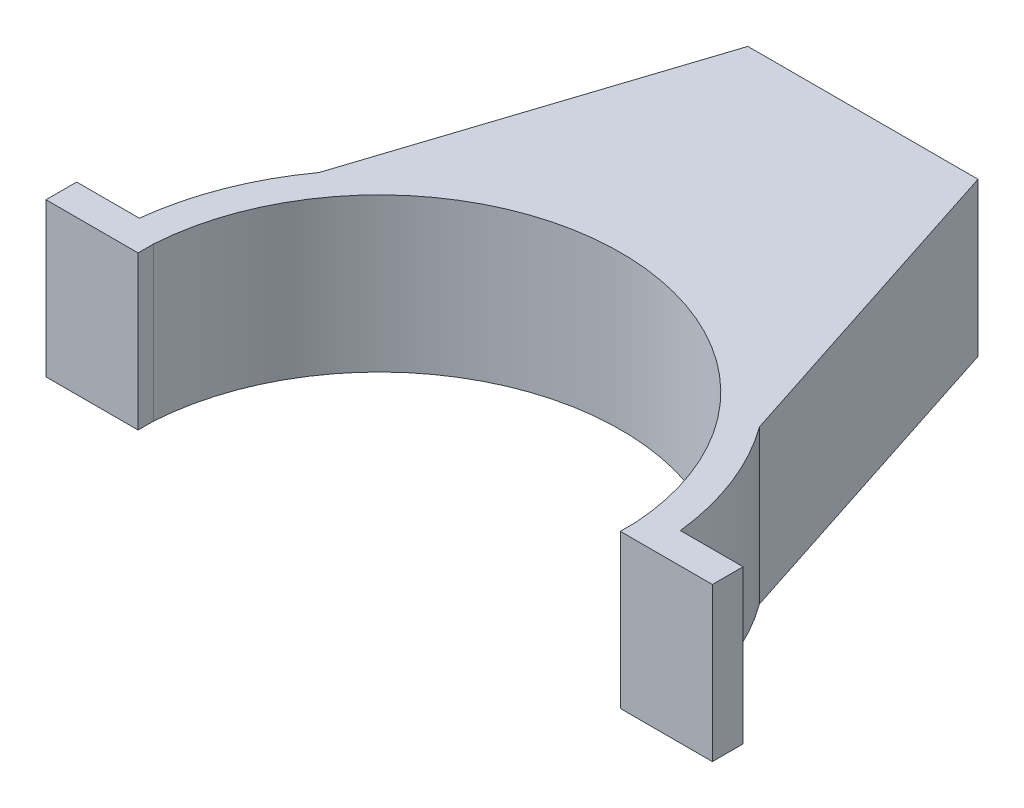
ISO-10303-21;
HEADER;
FILE_DESCRIPTION(('STEP AP214'),'2;1');
FILE_NAME('part.step','',(''),(''),'','','');
FILE_SCHEMA(('AUTOMOTIVE_DESIGN { 1 0 10303 214 1 1 1 1 }'));
ENDSEC;
DATA;
#1=APPLICATION_CONTEXT('core data for automotive mechanical design processes');
#2=APPLICATION_PROTOCOL_DEFINITION('international standard','automotive_design',2000,#1);
#3=PRODUCT_CONTEXT('',#1,'mechanical');
#4=PRODUCT('Part','Part','',(#3));
#5=PRODUCT_RELATED_PRODUCT_CATEGORY('part','',(#4));
#6=PRODUCT_DEFINITION_FORMATION('','',#4);
#7=PRODUCT_DEFINITION_CONTEXT('part definition',#1,'design');
#8=PRODUCT_DEFINITION('design','',#6,#7);
#9=PRODUCT_DEFINITION_SHAPE('','',#8);
#10=(LENGTH_UNIT() NAMED_UNIT(*) SI_UNIT(.MILLI.,.METRE.));
#11=(NAMED_UNIT(*) PLANE_ANGLE_UNIT() SI_UNIT($,.RADIAN.));
#12=(NAMED_UNIT(*) SI_UNIT($,.STERADIAN.) SOLID_ANGLE_UNIT());
#13=UNCERTAINTY_MEASURE_WITH_UNIT(LENGTH_MEASURE(1.E-05),#10,'distance_accuracy_value','');
#14=(GEOMETRIC_REPRESENTATION_CONTEXT(3) GLOBAL_UNCERTAINTY_ASSIGNED_CONTEXT((#13)) GLOBAL_UNIT_ASSIGNED_CONTEXT((#10,
#11,#12)) REPRESENTATION_CONTEXT('',''));
#15=CARTESIAN_POINT('',(0.,0.,0.));
#16=DIRECTION('',(0.,0.,1.));
#17=DIRECTION('',(1.,0.,0.));
#18=AXIS2_PLACEMENT_3D('',#15,#16,#17);
#19=CARTESIAN_POINT('',(0.,25.4,0.));
#20=DIRECTION('',(0.,-1.,0.));
#21=DIRECTION('',(0.,0.,-1.));
#22=AXIS2_PLACEMENT_3D('',#19,#20,#21);
#23=CYLINDRICAL_SURFACE('',#22,45.0723);
#24=DIRECTION('',(0.,-1.,0.));
#25=VECTOR('',#24,1.);
#26=CARTESIAN_POINT('',(-44.7851072041812,25.4,-5.08));
#27=LINE('',#26,#25);
#28=CARTESIAN_POINT('',(-44.7851072041812,25.4,-5.08));
#29=VERTEX_POINT('',#28);
#30=CARTESIAN_POINT('',(-44.7851072041812,0.,-5.08));
#31=VERTEX_POINT('',#30);
#32=EDGE_CURVE('E227',#29,#31,#27,.T.);
#33=ORIENTED_EDGE('',*,*,#32,.F.);
#34=CARTESIAN_POINT('',(0.,25.4,0.));
#35=DIRECTION('',(0.,1.,0.));
#36=DIRECTION('',(0.,0.,1.));
#37=AXIS2_PLACEMENT_3D('',#34,#35,#36);
#38=CIRCLE('',#37,45.0723);
#39=CARTESIAN_POINT('',(-36.4636625539692,25.4,-26.4936509458449));
#40=VERTEX_POINT('',#39);
#41=EDGE_CURVE('E277',#40,#29,#38,.T.);
#42=ORIENTED_EDGE('',*,*,#41,.F.);
#43=DIRECTION('',(0.,-1.,0.));
#44=VECTOR('',#43,1.);
#45=CARTESIAN_POINT('',(-36.4636625539691,25.4,-26.4936509458449));
#46=LINE('',#45,#44);
#47=CARTESIAN_POINT('',(-36.4636625539692,0.,-26.4936509458449));
#48=VERTEX_POINT('',#47);
#49=EDGE_CURVE('E288',#48,#40,#46,.F.);
#50=ORIENTED_EDGE('',*,*,#49,.F.);
#51=CARTESIAN_POINT('',(0.,0.,0.));
#52=DIRECTION('',(0.,1.,0.));
#53=DIRECTION('',(0.,0.,1.));
#54=AXIS2_PLACEMENT_3D('',#51,#52,#53);
#55=CIRCLE('',#54,45.0723);
#56=EDGE_CURVE('E281',#48,#31,#55,.T.);
#57=ORIENTED_EDGE('',*,*,#56,.T.);
#58=EDGE_LOOP('',(#33,#42,#50,#57));
#59=FACE_BOUND('',#58,.T.);
#60=ADVANCED_FACE('F33',(#59),#23,.T.);
#61=CARTESIAN_POINT('',(44.7851072041812,25.4,-5.08));
#62=VERTEX_POINT('',#61);
#63=CARTESIAN_POINT('',(36.4636625539692,25.4,-26.4936509458449));
#64=VERTEX_POINT('',#63);
#65=EDGE_CURVE('E47',#62,#64,#38,.T.);
#66=ORIENTED_EDGE('',*,*,#65,.F.);
#67=DIRECTION('',(0.,-1.,0.));
#68=VECTOR('',#67,1.);
#69=CARTESIAN_POINT('',(44.7851072041812,25.4,-5.08));
#70=LINE('',#69,#68);
#71=CARTESIAN_POINT('',(44.7851072041812,0.,-5.08));
#72=VERTEX_POINT('',#71);
#73=EDGE_CURVE('E51',#62,#72,#70,.T.);
#74=ORIENTED_EDGE('',*,*,#73,.T.);
#75=CARTESIAN_POINT('',(36.4636625539692,0.,-26.4936509458449));
#76=VERTEX_POINT('',#75);
#77=EDGE_CURVE('E283',#72,#76,#55,.T.);
#78=ORIENTED_EDGE('',*,*,#77,.T.);
#79=DIRECTION('',(0.,-1.,0.));
#80=VECTOR('',#79,1.);
#81=CARTESIAN_POINT('',(36.4636625539692,25.4,-26.4936509458449));
#82=LINE('',#81,#80);
#83=EDGE_CURVE('E291',#64,#76,#82,.T.);
#84=ORIENTED_EDGE('',*,*,#83,.F.);
#85=EDGE_LOOP('',(#66,#74,#78,#84));
#86=FACE_BOUND('',#85,.T.);
#87=ADVANCED_FACE('F321',(#86),#23,.T.);
#88=CARTESIAN_POINT('',(0.,12.7,0.));
#89=DIRECTION('',(0.,-1.,0.));
#90=DIRECTION('',(0.,0.,1.));
#91=AXIS2_PLACEMENT_3D('',#88,#89,#90);
#92=CIRCLE('',#91,45.0723);
#93=CARTESIAN_POINT('',(-32.1308346523782,12.7,-31.6088862795185));
#94=VERTEX_POINT('',#93);
#95=CARTESIAN_POINT('',(32.1308346523782,12.7,-31.6088862795184));
#96=VERTEX_POINT('',#95);
#97=EDGE_CURVE('E232',#94,#96,#92,.T.);
#98=ORIENTED_EDGE('',*,*,#97,.T.);
#99=DIRECTION('',(0.,-1.,0.));
#100=VECTOR('',#99,1.);
#101=CARTESIAN_POINT('',(32.1308346523782,25.4,-31.6088862795184));
#102=LINE('',#101,#100);
#103=CARTESIAN_POINT('',(32.1308346523783,0.,-31.6088862795184));
#104=VERTEX_POINT('',#103);
#105=EDGE_CURVE('E280',#104,#96,#102,.F.);
#106=ORIENTED_EDGE('',*,*,#105,.F.);
#107=CARTESIAN_POINT('',(-32.1308346523783,0.,-31.6088862795184));
#108=VERTEX_POINT('',#107);
#109=EDGE_CURVE('E274',#104,#108,#55,.T.);
#110=ORIENTED_EDGE('',*,*,#109,.T.);
#111=DIRECTION('',(0.,-1.,0.));
#112=VECTOR('',#111,1.);
#113=CARTESIAN_POINT('',(-32.1308346523782,25.4,-31.6088862795185));
#114=LINE('',#113,#112);
#115=EDGE_CURVE('E286',#94,#108,#114,.T.);
#116=ORIENTED_EDGE('',*,*,#115,.F.);
#117=EDGE_LOOP('',(#98,#106,#110,#116));
#118=FACE_BOUND('',#117,.T.);
#119=ADVANCED_FACE('F323',(#118),#23,.T.);
#120=CARTESIAN_POINT('',(-17.2046037357605,25.4,-77.5453488522659));
#121=DIRECTION('',(-0.951053051320249,0.,-0.309027658267742));
#122=DIRECTION('',(-0.309027658267742,0.,0.951053051320249));
#123=AXIS2_PLACEMENT_3D('',#120,#121,#122);
#124=PLANE('',#123);
#125=DIRECTION('',(-0.309027658267742,0.,0.951053051320249));
#126=VECTOR('',#125,1.);
#127=CARTESIAN_POINT('',(-32.1308346523783,12.7,-31.6088862795184));
#128=LINE('',#127,#126);
#129=CARTESIAN_POINT('',(-17.2046037357605,12.7,-77.5453488522659));
#130=VERTEX_POINT('',#129);
#131=EDGE_CURVE('E230',#130,#94,#128,.T.);
#132=ORIENTED_EDGE('',*,*,#131,.T.);
#133=ORIENTED_EDGE('',*,*,#115,.T.);
#134=DIRECTION('',(0.309027658267742,0.,-0.951053051320249));
#135=VECTOR('',#134,1.);
#136=CARTESIAN_POINT('',(-17.2046037357605,0.,-77.5453488522659));
#137=LINE('',#136,#135);
#138=CARTESIAN_POINT('',(-17.2046037357605,0.,-77.5453488522659));
#139=VERTEX_POINT('',#138);
#140=EDGE_CURVE('E255',#108,#139,#137,.T.);
#141=ORIENTED_EDGE('',*,*,#140,.T.);
#142=DIRECTION('',(0.,-1.,0.));
#143=VECTOR('',#142,1.);
#144=CARTESIAN_POINT('',(-17.2046037357605,25.4,-77.5453488522659));
#145=LINE('',#144,#143);
#146=EDGE_CURVE('E264',#130,#139,#145,.T.);
#147=ORIENTED_EDGE('',*,*,#146,.F.);
#148=EDGE_LOOP('',(#132,#133,#141,#147));
#149=FACE_BOUND('',#148,.T.);
#150=ADVANCED_FACE('F328',(#149),#124,.F.);
#151=CARTESIAN_POINT('',(42.6566252496466,25.4,0.784930252000061));
#152=DIRECTION('',(0.951053051320249,0.,-0.309027658267741));
#153=DIRECTION('',(-0.309027658267742,0.,-0.951053051320249));
#154=AXIS2_PLACEMENT_3D('',#151,#152,#153);
#155=PLANE('',#154);
#156=DIRECTION('',(-0.309027658267742,0.,-0.951053051320249));
#157=VECTOR('',#156,1.);
#158=CARTESIAN_POINT('',(17.2046037357605,12.7,-77.5453488522659));
#159=LINE('',#158,#157);
#160=CARTESIAN_POINT('',(17.2046037357605,12.7,-77.5453488522659));
#161=VERTEX_POINT('',#160);
#162=EDGE_CURVE('E234',#96,#161,#159,.T.);
#163=ORIENTED_EDGE('',*,*,#162,.T.);
#164=DIRECTION('',(0.,-1.,0.));
#165=VECTOR('',#164,1.);
#166=CARTESIAN_POINT('',(17.2046037357605,25.4,-77.5453488522659));
#167=LINE('',#166,#165);
#168=CARTESIAN_POINT('',(17.2046037357605,0.,-77.5453488522659));
#169=VERTEX_POINT('',#168);
#170=EDGE_CURVE('E248',#161,#169,#167,.T.);
#171=ORIENTED_EDGE('',*,*,#170,.T.);
#172=DIRECTION('',(0.309027658267742,0.,0.951053051320249));
#173=VECTOR('',#172,1.);
#174=CARTESIAN_POINT('',(42.6566252496466,0.,0.784930252000061));
#175=LINE('',#174,#173);
#176=EDGE_CURVE('E243',#169,#104,#175,.T.);
#177=ORIENTED_EDGE('',*,*,#176,.T.);
#178=ORIENTED_EDGE('',*,*,#105,.T.);
#179=EDGE_LOOP('',(#163,#171,#177,#178));
#180=FACE_BOUND('',#179,.T.);
#181=ADVANCED_FACE('F333',(#180),#155,.F.);
#182=CARTESIAN_POINT('',(17.2046037357605,25.4,-77.5453488522659));
#183=DIRECTION('',(0.,0.,-1.));
#184=DIRECTION('',(-1.,0.,0.));
#185=AXIS2_PLACEMENT_3D('',#182,#183,#184);
#186=PLANE('',#185);
#187=DIRECTION('',(-1.,0.,0.));
#188=VECTOR('',#187,1.);
#189=CARTESIAN_POINT('',(-17.2046037357605,12.7,-77.5453488522659));
#190=LINE('',#189,#188);
#191=EDGE_CURVE('E237',#161,#130,#190,.T.);
#192=ORIENTED_EDGE('',*,*,#191,.T.);
#193=ORIENTED_EDGE('',*,*,#146,.T.);
#194=DIRECTION('',(1.,0.,0.));
#195=VECTOR('',#194,1.);
#196=CARTESIAN_POINT('',(17.2046037357605,0.,-77.5453488522659));
#197=LINE('',#196,#195);
#198=EDGE_CURVE('E258',#139,#169,#197,.T.);
#199=ORIENTED_EDGE('',*,*,#198,.T.);
#200=ORIENTED_EDGE('',*,*,#170,.F.);
#201=EDGE_LOOP('',(#192,#193,#199,#200));
#202=FACE_BOUND('',#201,.T.);
#203=ADVANCED_FACE('F349',(#202),#186,.F.);
#204=CARTESIAN_POINT('',(0.,25.4,0.));
#205=DIRECTION('',(0.,1.,0.));
#206=DIRECTION('',(0.,0.,1.));
#207=AXIS2_PLACEMENT_3D('',#204,#205,#206);
#208=PLANE('',#207);
#209=DIRECTION('',(-1.,0.,0.));
#210=VECTOR('',#209,1.);
#211=CARTESIAN_POINT('',(45.0006736315136,25.4,-5.08));
#212=LINE('',#211,#210);
#213=CARTESIAN_POINT('',(55.1606736315136,25.4,-5.08));
#214=VERTEX_POINT('',#213);
#215=EDGE_CURVE('E186',#214,#62,#212,.T.);
#216=ORIENTED_EDGE('',*,*,#215,.T.);
#217=ORIENTED_EDGE('',*,*,#65,.T.);
#218=DIRECTION('',(-0.309027658267742,0.,-0.951053051320249));
#219=VECTOR('',#218,1.);
#220=CARTESIAN_POINT('',(45.0723,25.4,0.));
#221=LINE('',#220,#219);
#222=CARTESIAN_POINT('',(19.05,25.4,-80.085348852266));
#223=VERTEX_POINT('',#222);
#224=EDGE_CURVE('E240',#64,#223,#221,.T.);
#225=ORIENTED_EDGE('',*,*,#224,.T.);
#226=DIRECTION('',(-1.,0.,0.));
#227=VECTOR('',#226,1.);
#228=CARTESIAN_POINT('',(19.05,25.4,-80.085348852266));
#229=LINE('',#228,#227);
#230=CARTESIAN_POINT('',(-19.05,25.4,-80.085348852266));
#231=VERTEX_POINT('',#230);
#232=EDGE_CURVE('E242',#223,#231,#229,.T.);
#233=ORIENTED_EDGE('',*,*,#232,.T.);
#234=DIRECTION('',(-0.309027658267742,0.,0.951053051320249));
#235=VECTOR('',#234,1.);
#236=CARTESIAN_POINT('',(-19.05,25.4,-80.085348852266));
#237=LINE('',#236,#235);
#238=EDGE_CURVE('E245',#231,#40,#237,.T.);
#239=ORIENTED_EDGE('',*,*,#238,.T.);
#240=ORIENTED_EDGE('',*,*,#41,.T.);
#241=DIRECTION('',(-1.,0.,0.));
#242=VECTOR('',#241,1.);
#243=CARTESIAN_POINT('',(-45.0006736315136,25.4,-5.08));
#244=LINE('',#243,#242);
#245=CARTESIAN_POINT('',(-55.1606736315136,25.4,-5.08));
#246=VERTEX_POINT('',#245);
#247=EDGE_CURVE('E203',#29,#246,#244,.T.);
#248=ORIENTED_EDGE('',*,*,#247,.T.);
#249=DIRECTION('',(0.,0.,-1.));
#250=VECTOR('',#249,1.);
#251=CARTESIAN_POINT('',(-55.1606736315136,25.4,0.));
#252=LINE('',#251,#250);
#253=CARTESIAN_POINT('',(-55.1606736315136,25.4,0.));
#254=VERTEX_POINT('',#253);
#255=EDGE_CURVE('E224',#254,#246,#252,.T.);
#256=ORIENTED_EDGE('',*,*,#255,.F.);
#257=DIRECTION('',(-1.,0.,0.));
#258=VECTOR('',#257,1.);
#259=CARTESIAN_POINT('',(-45.0006736315136,25.4,0.));
#260=LINE('',#259,#258);
#261=CARTESIAN_POINT('',(-39.9115579662082,25.4,0.));
#262=VERTEX_POINT('',#261);
#263=EDGE_CURVE('E199',#262,#254,#260,.T.);
#264=ORIENTED_EDGE('',*,*,#263,.F.);
#265=DIRECTION('',(0.,0.,-1.));
#266=VECTOR('',#265,1.);
#267=CARTESIAN_POINT('',(-39.9115579662082,25.4,0.));
#268=LINE('',#267,#266);
#269=CARTESIAN_POINT('',(-39.9115579662082,25.4,-2.54));
#270=VERTEX_POINT('',#269);
#271=EDGE_CURVE('E210',#262,#270,#268,.T.);
#272=ORIENTED_EDGE('',*,*,#271,.T.);
#273=CARTESIAN_POINT('',(0.,25.4,0.));
#274=DIRECTION('',(0.,1.,0.));
#275=DIRECTION('',(0.,0.,1.));
#276=AXIS2_PLACEMENT_3D('',#273,#274,#275);
#277=CIRCLE('',#276,39.9923);
#278=CARTESIAN_POINT('',(39.9115579662082,25.4,-2.54));
#279=VERTEX_POINT('',#278);
#280=EDGE_CURVE('E173',#279,#270,#277,.T.);
#281=ORIENTED_EDGE('',*,*,#280,.F.);
#282=DIRECTION('',(0.,0.,-1.));
#283=VECTOR('',#282,1.);
#284=CARTESIAN_POINT('',(39.9115579662082,25.4,0.));
#285=LINE('',#284,#283);
#286=CARTESIAN_POINT('',(39.9115579662082,25.4,0.));
#287=VERTEX_POINT('',#286);
#288=EDGE_CURVE('E169',#287,#279,#285,.T.);
#289=ORIENTED_EDGE('',*,*,#288,.F.);
#290=DIRECTION('',(-1.,0.,0.));
#291=VECTOR('',#290,1.);
#292=CARTESIAN_POINT('',(45.0006736315136,25.4,0.));
#293=LINE('',#292,#291);
#294=CARTESIAN_POINT('',(55.1606736315136,25.4,0.));
#295=VERTEX_POINT('',#294);
#296=EDGE_CURVE('E154',#295,#287,#293,.T.);
#297=ORIENTED_EDGE('',*,*,#296,.F.);
#298=DIRECTION('',(0.,0.,-1.));
#299=VECTOR('',#298,1.);
#300=CARTESIAN_POINT('',(55.1606736315136,25.4,0.));
#301=LINE('',#300,#299);
#302=EDGE_CURVE('E185',#295,#214,#301,.T.);
#303=ORIENTED_EDGE('',*,*,#302,.T.);
#304=EDGE_LOOP('',(#216,#217,#225,#233,#239,#240,#248,#256,#264,#272,#281,#289,#297,#303));
#305=FACE_BOUND('',#304,.T.);
#306=ADVANCED_FACE('F171',(#305),#208,.T.);
#307=CARTESIAN_POINT('',(0.,0.,0.));
#308=DIRECTION('',(0.,1.,0.));
#309=DIRECTION('',(0.,0.,1.));
#310=AXIS2_PLACEMENT_3D('',#307,#308,#309);
#311=PLANE('',#310);
#312=ORIENTED_EDGE('',*,*,#77,.F.);
#313=DIRECTION('',(1.,0.,0.));
#314=VECTOR('',#313,1.);
#315=CARTESIAN_POINT('',(55.1606736315136,0.,-5.08));
#316=LINE('',#315,#314);
#317=CARTESIAN_POINT('',(55.1606736315136,0.,-5.08));
#318=VERTEX_POINT('',#317);
#319=EDGE_CURVE('E188',#72,#318,#316,.T.);
#320=ORIENTED_EDGE('',*,*,#319,.T.);
#321=DIRECTION('',(0.,0.,-1.));
#322=VECTOR('',#321,1.);
#323=CARTESIAN_POINT('',(55.1606736315136,0.,0.));
#324=LINE('',#323,#322);
#325=CARTESIAN_POINT('',(55.1606736315136,0.,0.));
#326=VERTEX_POINT('',#325);
#327=EDGE_CURVE('E193',#326,#318,#324,.T.);
#328=ORIENTED_EDGE('',*,*,#327,.F.);
#329=DIRECTION('',(1.,0.,0.));
#330=VECTOR('',#329,1.);
#331=CARTESIAN_POINT('',(45.0864540245331,0.,0.));
#332=LINE('',#331,#330);
#333=CARTESIAN_POINT('',(39.9115579662082,0.,0.));
#334=VERTEX_POINT('',#333);
#335=EDGE_CURVE('E180',#334,#326,#332,.T.);
#336=ORIENTED_EDGE('',*,*,#335,.F.);
#337=DIRECTION('',(0.,0.,-1.));
#338=VECTOR('',#337,1.);
#339=CARTESIAN_POINT('',(39.9115579662082,0.,0.));
#340=LINE('',#339,#338);
#341=CARTESIAN_POINT('',(39.9115579662082,0.,-2.54));
#342=VERTEX_POINT('',#341);
#343=EDGE_CURVE('E175',#334,#342,#340,.T.);
#344=ORIENTED_EDGE('',*,*,#343,.T.);
#345=CARTESIAN_POINT('',(0.,0.,0.));
#346=DIRECTION('',(0.,1.,0.));
#347=DIRECTION('',(0.,0.,1.));
#348=AXIS2_PLACEMENT_3D('',#345,#346,#347);
#349=CIRCLE('',#348,39.9923);
#350=CARTESIAN_POINT('',(-39.9115579662082,0.,-2.54));
#351=VERTEX_POINT('',#350);
#352=EDGE_CURVE('E272',#342,#351,#349,.T.);
#353=ORIENTED_EDGE('',*,*,#352,.T.);
#354=DIRECTION('',(0.,0.,-1.));
#355=VECTOR('',#354,1.);
#356=CARTESIAN_POINT('',(-39.9115579662082,0.,0.));
#357=LINE('',#356,#355);
#358=CARTESIAN_POINT('',(-39.9115579662082,0.,0.));
#359=VERTEX_POINT('',#358);
#360=EDGE_CURVE('E218',#359,#351,#357,.T.);
#361=ORIENTED_EDGE('',*,*,#360,.F.);
#362=DIRECTION('',(1.,0.,0.));
#363=VECTOR('',#362,1.);
#364=CARTESIAN_POINT('',(-55.1606736315136,0.,0.));
#365=LINE('',#364,#363);
#366=CARTESIAN_POINT('',(-55.1606736315136,0.,0.));
#367=VERTEX_POINT('',#366);
#368=EDGE_CURVE('E205',#367,#359,#365,.T.);
#369=ORIENTED_EDGE('',*,*,#368,.F.);
#370=DIRECTION('',(0.,0.,-1.));
#371=VECTOR('',#370,1.);
#372=CARTESIAN_POINT('',(-55.1606736315136,0.,0.));
#373=LINE('',#372,#371);
#374=CARTESIAN_POINT('',(-55.1606736315136,0.,-5.08));
#375=VERTEX_POINT('',#374);
#376=EDGE_CURVE('E221',#367,#375,#373,.T.);
#377=ORIENTED_EDGE('',*,*,#376,.T.);
#378=DIRECTION('',(1.,0.,0.));
#379=VECTOR('',#378,1.);
#380=CARTESIAN_POINT('',(-45.0864540245331,0.,-5.08));
#381=LINE('',#380,#379);
#382=EDGE_CURVE('E213',#375,#31,#381,.T.);
#383=ORIENTED_EDGE('',*,*,#382,.T.);
#384=ORIENTED_EDGE('',*,*,#56,.F.);
#385=DIRECTION('',(-0.309027658267742,0.,0.951053051320249));
#386=VECTOR('',#385,1.);
#387=CARTESIAN_POINT('',(-19.05,0.,-80.085348852266));
#388=LINE('',#387,#386);
#389=CARTESIAN_POINT('',(-19.05,0.,-80.085348852266));
#390=VERTEX_POINT('',#389);
#391=EDGE_CURVE('E252',#390,#48,#388,.T.);
#392=ORIENTED_EDGE('',*,*,#391,.F.);
#393=DIRECTION('',(-1.,0.,0.));
#394=VECTOR('',#393,1.);
#395=CARTESIAN_POINT('',(19.05,0.,-80.085348852266));
#396=LINE('',#395,#394);
#397=CARTESIAN_POINT('',(19.05,0.,-80.085348852266));
#398=VERTEX_POINT('',#397);
#399=EDGE_CURVE('E250',#398,#390,#396,.T.);
#400=ORIENTED_EDGE('',*,*,#399,.F.);
#401=DIRECTION('',(-0.309027658267742,0.,-0.951053051320249));
#402=VECTOR('',#401,1.);
#403=CARTESIAN_POINT('',(45.0723,0.,0.));
#404=LINE('',#403,#402);
#405=EDGE_CURVE('E239',#76,#398,#404,.T.);
#406=ORIENTED_EDGE('',*,*,#405,.F.);
#407=EDGE_LOOP('',(#312,#320,#328,#336,#344,#353,#361,#369,#377,#383,#384,#392,#400,#406));
#408=FACE_BOUND('',#407,.T.);
#409=ORIENTED_EDGE('',*,*,#140,.F.);
#410=ORIENTED_EDGE('',*,*,#109,.F.);
#411=ORIENTED_EDGE('',*,*,#176,.F.);
#412=ORIENTED_EDGE('',*,*,#198,.F.);
#413=EDGE_LOOP('',(#409,#410,#411,#412));
#414=FACE_BOUND('',#413,.T.);
#415=ADVANCED_FACE('F306',(#408,#414),#311,.F.);
#416=CARTESIAN_POINT('',(0.,25.4,0.));
#417=DIRECTION('',(0.,-1.,0.));
#418=DIRECTION('',(0.,0.,-1.));
#419=AXIS2_PLACEMENT_3D('',#416,#417,#418);
#420=CYLINDRICAL_SURFACE('',#419,39.9923);
#421=DIRECTION('',(0.,-1.,0.));
#422=VECTOR('',#421,1.);
#423=CARTESIAN_POINT('',(39.9115579662082,25.4,-2.54));
#424=LINE('',#423,#422);
#425=EDGE_CURVE('E11',#279,#342,#424,.T.);
#426=ORIENTED_EDGE('',*,*,#425,.F.);
#427=ORIENTED_EDGE('',*,*,#280,.T.);
#428=DIRECTION('',(0.,-1.,0.));
#429=VECTOR('',#428,1.);
#430=CARTESIAN_POINT('',(-39.9115579662082,25.4,-2.54));
#431=LINE('',#430,#429);
#432=EDGE_CURVE('E40',#351,#270,#431,.F.);
#433=ORIENTED_EDGE('',*,*,#432,.F.);
#434=ORIENTED_EDGE('',*,*,#352,.F.);
#435=EDGE_LOOP('',(#426,#427,#433,#434));
#436=FACE_BOUND('',#435,.T.);
#437=ADVANCED_FACE('F308',(#436),#420,.F.);
#438=CARTESIAN_POINT('',(45.0723,25.4,0.));
#439=DIRECTION('',(-0.951053051320249,0.,0.309027658267741));
#440=DIRECTION('',(0.309027658267742,0.,0.951053051320249));
#441=AXIS2_PLACEMENT_3D('',#438,#439,#440);
#442=PLANE('',#441);
#443=ORIENTED_EDGE('',*,*,#224,.F.);
#444=ORIENTED_EDGE('',*,*,#83,.T.);
#445=ORIENTED_EDGE('',*,*,#405,.T.);
#446=DIRECTION('',(0.,-1.,0.));
#447=VECTOR('',#446,1.);
#448=CARTESIAN_POINT('',(19.05,25.4,-80.085348852266));
#449=LINE('',#448,#447);
#450=EDGE_CURVE('E269',#223,#398,#449,.T.);
#451=ORIENTED_EDGE('',*,*,#450,.F.);
#452=EDGE_LOOP('',(#443,#444,#445,#451));
#453=FACE_BOUND('',#452,.T.);
#454=ADVANCED_FACE('F310',(#453),#442,.F.);
#455=CARTESIAN_POINT('',(-19.05,25.4,-80.085348852266));
#456=DIRECTION('',(0.951053051320249,0.,0.309027658267741));
#457=DIRECTION('',(0.309027658267742,0.,-0.951053051320249));
#458=AXIS2_PLACEMENT_3D('',#455,#456,#457);
#459=PLANE('',#458);
#460=ORIENTED_EDGE('',*,*,#391,.T.);
#461=ORIENTED_EDGE('',*,*,#49,.T.);
#462=ORIENTED_EDGE('',*,*,#238,.F.);
#463=DIRECTION('',(0.,-1.,0.));
#464=VECTOR('',#463,1.);
#465=CARTESIAN_POINT('',(-19.05,25.4,-80.085348852266));
#466=LINE('',#465,#464);
#467=EDGE_CURVE('E266',#231,#390,#466,.T.);
#468=ORIENTED_EDGE('',*,*,#467,.T.);
#469=EDGE_LOOP('',(#460,#461,#462,#468));
#470=FACE_BOUND('',#469,.T.);
#471=ADVANCED_FACE('F316',(#470),#459,.F.);
#472=CARTESIAN_POINT('',(19.05,25.4,-80.085348852266));
#473=DIRECTION('',(0.,0.,1.));
#474=DIRECTION('',(1.,0.,0.));
#475=AXIS2_PLACEMENT_3D('',#472,#473,#474);
#476=PLANE('',#475);
#477=ORIENTED_EDGE('',*,*,#399,.T.);
#478=ORIENTED_EDGE('',*,*,#467,.F.);
#479=ORIENTED_EDGE('',*,*,#232,.F.);
#480=ORIENTED_EDGE('',*,*,#450,.T.);
#481=EDGE_LOOP('',(#477,#478,#479,#480));
#482=FACE_BOUND('',#481,.T.);
#483=ADVANCED_FACE('F360',(#482),#476,.F.);
#484=CARTESIAN_POINT('',(0.,12.7,0.));
#485=DIRECTION('',(0.,1.,0.));
#486=DIRECTION('',(0.,0.,1.));
#487=AXIS2_PLACEMENT_3D('',#484,#485,#486);
#488=PLANE('',#487);
#489=ORIENTED_EDGE('',*,*,#131,.F.);
#490=ORIENTED_EDGE('',*,*,#191,.F.);
#491=ORIENTED_EDGE('',*,*,#162,.F.);
#492=ORIENTED_EDGE('',*,*,#97,.F.);
#493=EDGE_LOOP('',(#489,#490,#491,#492));
#494=FACE_BOUND('',#493,.T.);
#495=ADVANCED_FACE('F346',(#494),#488,.F.);
#496=CARTESIAN_POINT('',(0.,0.,-5.08));
#497=DIRECTION('',(0.,0.,1.));
#498=DIRECTION('',(1.,0.,0.));
#499=AXIS2_PLACEMENT_3D('',#496,#497,#498);
#500=PLANE('',#499);
#501=ORIENTED_EDGE('',*,*,#247,.F.);
#502=ORIENTED_EDGE('',*,*,#32,.T.);
#503=ORIENTED_EDGE('',*,*,#382,.F.);
#504=DIRECTION('',(0.,-1.,0.));
#505=VECTOR('',#504,1.);
#506=CARTESIAN_POINT('',(-55.1606736315136,25.4,-5.08));
#507=LINE('',#506,#505);
#508=EDGE_CURVE('E198',#246,#375,#507,.T.);
#509=ORIENTED_EDGE('',*,*,#508,.F.);
#510=EDGE_LOOP('',(#501,#502,#503,#509));
#511=FACE_BOUND('',#510,.T.);
#512=ADVANCED_FACE('F385',(#511),#500,.F.);
#513=CARTESIAN_POINT('',(-39.9115579662082,25.4,0.));
#514=DIRECTION('',(-1.,0.,0.));
#515=DIRECTION('',(0.,0.,1.));
#516=AXIS2_PLACEMENT_3D('',#513,#514,#515);
#517=PLANE('',#516);
#518=ORIENTED_EDGE('',*,*,#360,.T.);
#519=ORIENTED_EDGE('',*,*,#432,.T.);
#520=ORIENTED_EDGE('',*,*,#271,.F.);
#521=DIRECTION('',(0.,1.,0.));
#522=VECTOR('',#521,1.);
#523=CARTESIAN_POINT('',(-39.9115579662082,25.4,0.));
#524=LINE('',#523,#522);
#525=EDGE_CURVE('E207',#359,#262,#524,.T.);
#526=ORIENTED_EDGE('',*,*,#525,.F.);
#527=EDGE_LOOP('',(#518,#519,#520,#526));
#528=FACE_BOUND('',#527,.T.);
#529=ADVANCED_FACE('F296',(#528),#517,.F.);
#530=CARTESIAN_POINT('',(-55.1606736315136,25.4,0.));
#531=DIRECTION('',(1.,0.,0.));
#532=DIRECTION('',(0.,0.,-1.));
#533=AXIS2_PLACEMENT_3D('',#530,#531,#532);
#534=PLANE('',#533);
#535=ORIENTED_EDGE('',*,*,#508,.T.);
#536=ORIENTED_EDGE('',*,*,#376,.F.);
#537=DIRECTION('',(0.,-1.,0.));
#538=VECTOR('',#537,1.);
#539=CARTESIAN_POINT('',(-55.1606736315136,25.4,0.));
#540=LINE('',#539,#538);
#541=EDGE_CURVE('E202',#254,#367,#540,.T.);
#542=ORIENTED_EDGE('',*,*,#541,.F.);
#543=ORIENTED_EDGE('',*,*,#255,.T.);
#544=EDGE_LOOP('',(#535,#536,#542,#543));
#545=FACE_BOUND('',#544,.T.);
#546=ADVANCED_FACE('F384',(#545),#534,.F.);
#547=CARTESIAN_POINT('',(0.,0.,0.));
#548=DIRECTION('',(0.,0.,1.));
#549=DIRECTION('',(1.,0.,0.));
#550=AXIS2_PLACEMENT_3D('',#547,#548,#549);
#551=PLANE('',#550);
#552=ORIENTED_EDGE('',*,*,#263,.T.);
#553=ORIENTED_EDGE('',*,*,#541,.T.);
#554=ORIENTED_EDGE('',*,*,#368,.T.);
#555=ORIENTED_EDGE('',*,*,#525,.T.);
#556=EDGE_LOOP('',(#552,#553,#554,#555));
#557=FACE_BOUND('',#556,.T.);
#558=ADVANCED_FACE('F302',(#557),#551,.T.);
#559=CARTESIAN_POINT('',(0.,0.,-5.08));
#560=DIRECTION('',(0.,0.,-1.));
#561=DIRECTION('',(-1.,0.,0.));
#562=AXIS2_PLACEMENT_3D('',#559,#560,#561);
#563=PLANE('',#562);
#564=ORIENTED_EDGE('',*,*,#73,.F.);
#565=ORIENTED_EDGE('',*,*,#215,.F.);
#566=DIRECTION('',(0.,1.,0.));
#567=VECTOR('',#566,1.);
#568=CARTESIAN_POINT('',(55.1606736315136,25.4,-5.08));
#569=LINE('',#568,#567);
#570=EDGE_CURVE('E165',#318,#214,#569,.T.);
#571=ORIENTED_EDGE('',*,*,#570,.F.);
#572=ORIENTED_EDGE('',*,*,#319,.F.);
#573=EDGE_LOOP('',(#564,#565,#571,#572));
#574=FACE_BOUND('',#573,.T.);
#575=ADVANCED_FACE('F368',(#574),#563,.T.);
#576=CARTESIAN_POINT('',(39.9115579662082,25.4,0.));
#577=DIRECTION('',(1.,0.,0.));
#578=DIRECTION('',(0.,0.,-1.));
#579=AXIS2_PLACEMENT_3D('',#576,#577,#578);
#580=PLANE('',#579);
#581=ORIENTED_EDGE('',*,*,#288,.T.);
#582=ORIENTED_EDGE('',*,*,#425,.T.);
#583=ORIENTED_EDGE('',*,*,#343,.F.);
#584=DIRECTION('',(0.,-1.,0.));
#585=VECTOR('',#584,1.);
#586=CARTESIAN_POINT('',(39.9115579662082,25.4,0.));
#587=LINE('',#586,#585);
#588=EDGE_CURVE('E158',#287,#334,#587,.T.);
#589=ORIENTED_EDGE('',*,*,#588,.F.);
#590=EDGE_LOOP('',(#581,#582,#583,#589));
#591=FACE_BOUND('',#590,.T.);
#592=ADVANCED_FACE('F177',(#591),#580,.F.);
#593=CARTESIAN_POINT('',(55.1606736315136,25.4,0.));
#594=DIRECTION('',(-1.,0.,0.));
#595=DIRECTION('',(0.,0.,1.));
#596=AXIS2_PLACEMENT_3D('',#593,#594,#595);
#597=PLANE('',#596);
#598=ORIENTED_EDGE('',*,*,#570,.T.);
#599=ORIENTED_EDGE('',*,*,#302,.F.);
#600=DIRECTION('',(0.,1.,0.));
#601=VECTOR('',#600,1.);
#602=CARTESIAN_POINT('',(55.1606736315136,25.4,0.));
#603=LINE('',#602,#601);
#604=EDGE_CURVE('E161',#326,#295,#603,.T.);
#605=ORIENTED_EDGE('',*,*,#604,.F.);
#606=ORIENTED_EDGE('',*,*,#327,.T.);
#607=EDGE_LOOP('',(#598,#599,#605,#606));
#608=FACE_BOUND('',#607,.T.);
#609=ADVANCED_FACE('F370',(#608),#597,.F.);
#610=CARTESIAN_POINT('',(0.,0.,0.));
#611=DIRECTION('',(0.,0.,-1.));
#612=DIRECTION('',(-1.,0.,0.));
#613=AXIS2_PLACEMENT_3D('',#610,#611,#612);
#614=PLANE('',#613);
#615=ORIENTED_EDGE('',*,*,#296,.T.);
#616=ORIENTED_EDGE('',*,*,#588,.T.);
#617=ORIENTED_EDGE('',*,*,#335,.T.);
#618=ORIENTED_EDGE('',*,*,#604,.T.);
#619=EDGE_LOOP('',(#615,#616,#617,#618));
#620=FACE_BOUND('',#619,.T.);
#621=ADVANCED_FACE('F156',(#620),#614,.F.);
#622=CLOSED_SHELL('',(#60,#87,#119,#150,#181,#203,#306,#415,#437,#454,#471,#483,#495,#512,#529,
#546,#558,#575,#592,#609,#621));
#623=MANIFOLD_SOLID_BREP('B2',#622);
#624=ADVANCED_BREP_SHAPE_REPRESENTATION('',(#18,#623),#14);
#625=SHAPE_DEFINITION_REPRESENTATION(#9,#624);
ENDSEC;
END-ISO-10303-21;
